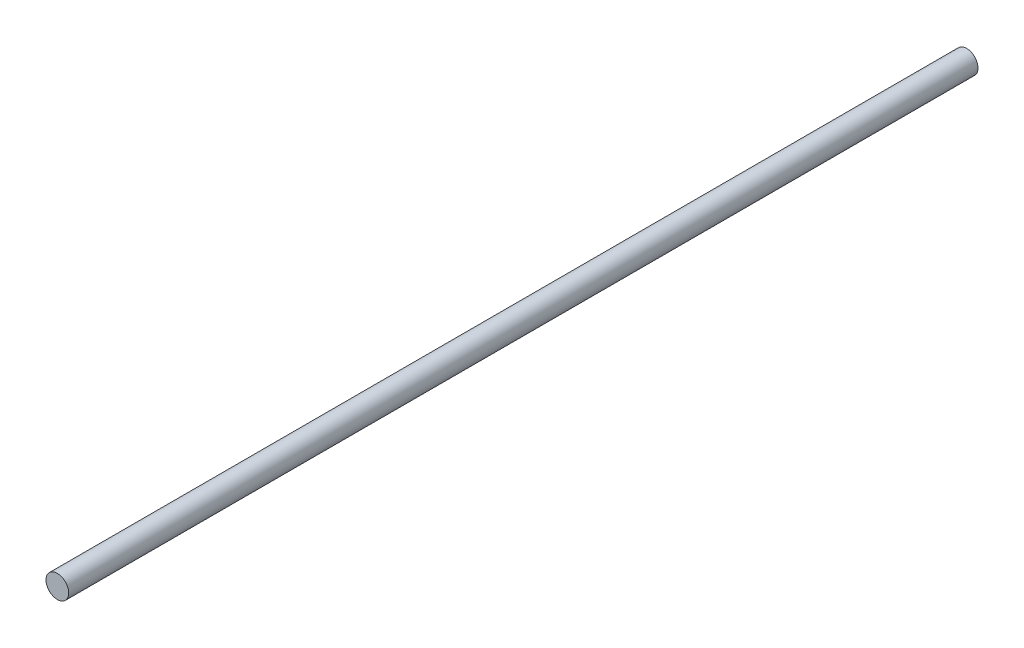
ISO-10303-21;
HEADER;
FILE_DESCRIPTION(('STEP AP214'),'2;1');
FILE_NAME('part.step','',(''),(''),'','','');
FILE_SCHEMA(('AUTOMOTIVE_DESIGN { 1 0 10303 214 1 1 1 1 }'));
ENDSEC;
DATA;
#1=APPLICATION_CONTEXT('core data for automotive mechanical design processes');
#2=APPLICATION_PROTOCOL_DEFINITION('international standard','automotive_design',2000,#1);
#3=PRODUCT_CONTEXT('',#1,'mechanical');
#4=PRODUCT('Part','Part','',(#3));
#5=PRODUCT_RELATED_PRODUCT_CATEGORY('part','',(#4));
#6=PRODUCT_DEFINITION_FORMATION('','',#4);
#7=PRODUCT_DEFINITION_CONTEXT('part definition',#1,'design');
#8=PRODUCT_DEFINITION('design','',#6,#7);
#9=PRODUCT_DEFINITION_SHAPE('','',#8);
#10=(LENGTH_UNIT() NAMED_UNIT(*) SI_UNIT(.MILLI.,.METRE.));
#11=(NAMED_UNIT(*) PLANE_ANGLE_UNIT() SI_UNIT($,.RADIAN.));
#12=(NAMED_UNIT(*) SI_UNIT($,.STERADIAN.) SOLID_ANGLE_UNIT());
#13=UNCERTAINTY_MEASURE_WITH_UNIT(LENGTH_MEASURE(1.E-05),#10,'distance_accuracy_value','');
#14=(GEOMETRIC_REPRESENTATION_CONTEXT(3) GLOBAL_UNCERTAINTY_ASSIGNED_CONTEXT((#13)) GLOBAL_UNIT_ASSIGNED_CONTEXT((#10,
#11,#12)) REPRESENTATION_CONTEXT('',''));
#15=CARTESIAN_POINT('',(0.,0.,0.));
#16=DIRECTION('',(0.,0.,1.));
#17=DIRECTION('',(1.,0.,0.));
#18=AXIS2_PLACEMENT_3D('',#15,#16,#17);
#19=CARTESIAN_POINT('',(-8.76111799363543,6.92410938206671,400.));
#20=DIRECTION('',(0.,0.,-1.));
#21=DIRECTION('',(-1.,0.,0.));
#22=AXIS2_PLACEMENT_3D('',#19,#20,#21);
#23=CYLINDRICAL_SURFACE('',#22,5.);
#24=CARTESIAN_POINT('',(-8.76111799363543,6.92410938206671,400.));
#25=DIRECTION('',(0.,0.,1.));
#26=DIRECTION('',(1.,0.,0.));
#27=AXIS2_PLACEMENT_3D('',#24,#25,#26);
#28=CIRCLE('',#27,5.);
#29=CARTESIAN_POINT('',(-3.76111799363543,6.92410938206671,400.));
#30=VERTEX_POINT('',#29);
#31=EDGE_CURVE('E10',#30,#30,#28,.T.);
#32=ORIENTED_EDGE('',*,*,#31,.F.);
#33=EDGE_LOOP('',(#32));
#34=FACE_BOUND('',#33,.T.);
#35=CARTESIAN_POINT('',(-8.76111799363543,6.92410938206671,0.));
#36=DIRECTION('',(0.,0.,1.));
#37=DIRECTION('',(1.,0.,0.));
#38=AXIS2_PLACEMENT_3D('',#35,#36,#37);
#39=CIRCLE('',#38,5.);
#40=CARTESIAN_POINT('',(-3.76111799363543,6.92410938206671,0.));
#41=VERTEX_POINT('',#40);
#42=EDGE_CURVE('E40',#41,#41,#39,.T.);
#43=ORIENTED_EDGE('',*,*,#42,.T.);
#44=EDGE_LOOP('',(#43));
#45=FACE_BOUND('',#44,.T.);
#46=ADVANCED_FACE('F37',(#34,#45),#23,.T.);
#47=CARTESIAN_POINT('',(-8.76111799363543,6.92410938206671,400.));
#48=DIRECTION('',(0.,0.,1.));
#49=DIRECTION('',(1.,0.,0.));
#50=AXIS2_PLACEMENT_3D('',#47,#48,#49);
#51=PLANE('',#50);
#52=ORIENTED_EDGE('',*,*,#31,.T.);
#53=EDGE_LOOP('',(#52));
#54=FACE_BOUND('',#53,.T.);
#55=ADVANCED_FACE('F54',(#54),#51,.T.);
#56=CARTESIAN_POINT('',(-8.76111799363543,6.92410938206671,0.));
#57=DIRECTION('',(0.,0.,1.));
#58=DIRECTION('',(1.,0.,0.));
#59=AXIS2_PLACEMENT_3D('',#56,#57,#58);
#60=PLANE('',#59);
#61=ORIENTED_EDGE('',*,*,#42,.F.);
#62=EDGE_LOOP('',(#61));
#63=FACE_BOUND('',#62,.T.);
#64=ADVANCED_FACE('F52',(#63),#60,.F.);
#65=CLOSED_SHELL('',(#46,#55,#64));
#66=MANIFOLD_SOLID_BREP('B2',#65);
#67=ADVANCED_BREP_SHAPE_REPRESENTATION('',(#18,#66),#14);
#68=SHAPE_DEFINITION_REPRESENTATION(#9,#67);
ENDSEC;
END-ISO-10303-21;
